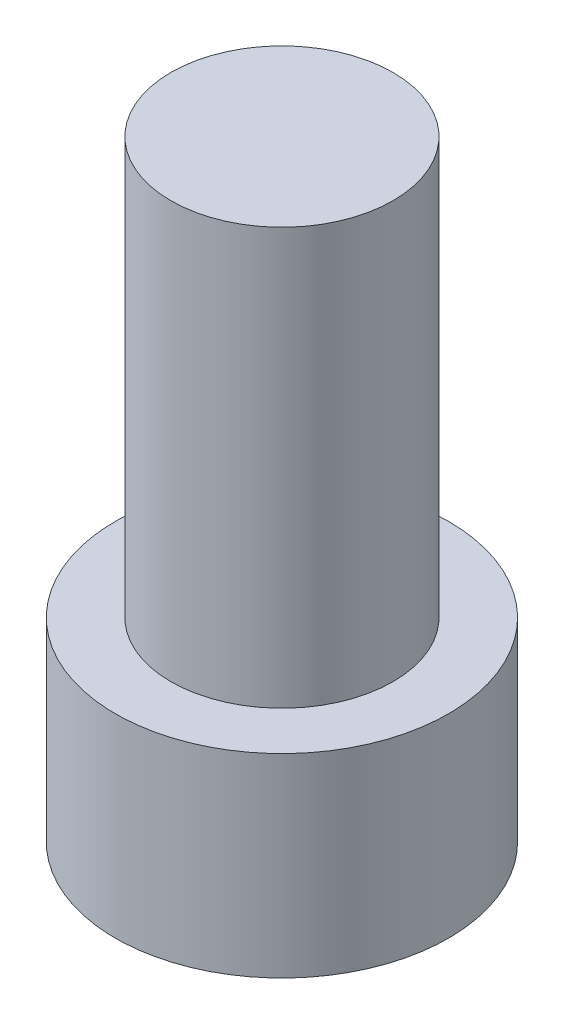
ISO-10303-21;
HEADER;
FILE_DESCRIPTION(('STEP AP214'),'2;1');
FILE_NAME('part.step','',(''),(''),'','','');
FILE_SCHEMA(('AUTOMOTIVE_DESIGN { 1 0 10303 214 1 1 1 1 }'));
ENDSEC;
DATA;
#1=APPLICATION_CONTEXT('core data for automotive mechanical design processes');
#2=APPLICATION_PROTOCOL_DEFINITION('international standard','automotive_design',2000,#1);
#3=PRODUCT_CONTEXT('',#1,'mechanical');
#4=PRODUCT('Part','Part','',(#3));
#5=PRODUCT_RELATED_PRODUCT_CATEGORY('part','',(#4));
#6=PRODUCT_DEFINITION_FORMATION('','',#4);
#7=PRODUCT_DEFINITION_CONTEXT('part definition',#1,'design');
#8=PRODUCT_DEFINITION('design','',#6,#7);
#9=PRODUCT_DEFINITION_SHAPE('','',#8);
#10=(LENGTH_UNIT() NAMED_UNIT(*) SI_UNIT(.MILLI.,.METRE.));
#11=(NAMED_UNIT(*) PLANE_ANGLE_UNIT() SI_UNIT($,.RADIAN.));
#12=(NAMED_UNIT(*) SI_UNIT($,.STERADIAN.) SOLID_ANGLE_UNIT());
#13=UNCERTAINTY_MEASURE_WITH_UNIT(LENGTH_MEASURE(1.E-05),#10,'distance_accuracy_value','');
#14=(GEOMETRIC_REPRESENTATION_CONTEXT(3) GLOBAL_UNCERTAINTY_ASSIGNED_CONTEXT((#13)) GLOBAL_UNIT_ASSIGNED_CONTEXT((#10,
#11,#12)) REPRESENTATION_CONTEXT('',''));
#15=CARTESIAN_POINT('',(0.,0.,0.));
#16=DIRECTION('',(0.,0.,1.));
#17=DIRECTION('',(1.,0.,0.));
#18=AXIS2_PLACEMENT_3D('',#15,#16,#17);
#19=CARTESIAN_POINT('',(0.,-2.,0.));
#20=DIRECTION('',(0.,1.,0.));
#21=DIRECTION('',(0.,0.,1.));
#22=AXIS2_PLACEMENT_3D('',#19,#20,#21);
#23=CYLINDRICAL_SURFACE('',#22,6.);
#24=CARTESIAN_POINT('',(0.,0.,0.));
#25=DIRECTION('',(0.,-1.,0.));
#26=DIRECTION('',(0.,0.,-1.));
#27=AXIS2_PLACEMENT_3D('',#24,#25,#26);
#28=CIRCLE('',#27,6.);
#29=CARTESIAN_POINT('',(0.,0.,-6.));
#30=VERTEX_POINT('',#29);
#31=EDGE_CURVE('E12',#30,#30,#28,.T.);
#32=ORIENTED_EDGE('',*,*,#31,.T.);
#33=EDGE_LOOP('',(#32));
#34=FACE_BOUND('',#33,.T.);
#35=CARTESIAN_POINT('',(0.,-7.,0.));
#36=DIRECTION('',(0.,-1.,0.));
#37=DIRECTION('',(0.,0.,-1.));
#38=AXIS2_PLACEMENT_3D('',#35,#36,#37);
#39=CIRCLE('',#38,6.);
#40=CARTESIAN_POINT('',(0.,-7.,-6.));
#41=VERTEX_POINT('',#40);
#42=EDGE_CURVE('E58',#41,#41,#39,.T.);
#43=ORIENTED_EDGE('',*,*,#42,.F.);
#44=EDGE_LOOP('',(#43));
#45=FACE_BOUND('',#44,.T.);
#46=ADVANCED_FACE('F51',(#34,#45),#23,.T.);
#47=CARTESIAN_POINT('',(0.,0.,0.));
#48=DIRECTION('',(0.,-1.,0.));
#49=DIRECTION('',(0.,0.,-1.));
#50=AXIS2_PLACEMENT_3D('',#47,#48,#49);
#51=PLANE('',#50);
#52=ORIENTED_EDGE('',*,*,#31,.F.);
#53=EDGE_LOOP('',(#52));
#54=FACE_BOUND('',#53,.T.);
#55=ADVANCED_FACE('F157',(#54),#51,.F.);
#56=CARTESIAN_POINT('',(0.,-7.,0.));
#57=DIRECTION('',(0.,-1.,0.));
#58=DIRECTION('',(0.,0.,-1.));
#59=AXIS2_PLACEMENT_3D('',#56,#57,#58);
#60=PLANE('',#59);
#61=ORIENTED_EDGE('',*,*,#42,.T.);
#62=EDGE_LOOP('',(#61));
#63=FACE_BOUND('',#62,.T.);
#64=DIRECTION('',(-0.5,0.,0.866025403784439));
#65=VECTOR('',#64,1.);
#66=CARTESIAN_POINT('',(4.61880215351701,-7.,0.));
#67=LINE('',#66,#65);
#68=CARTESIAN_POINT('',(4.61880215351701,-7.,0.));
#69=VERTEX_POINT('',#68);
#70=CARTESIAN_POINT('',(2.3094010767585,-7.,4.));
#71=VERTEX_POINT('',#70);
#72=EDGE_CURVE('E111',#69,#71,#67,.T.);
#73=ORIENTED_EDGE('',*,*,#72,.F.);
#74=DIRECTION('',(0.5,0.,0.866025403784439));
#75=VECTOR('',#74,1.);
#76=CARTESIAN_POINT('',(2.3094010767585,-7.,-4.));
#77=LINE('',#76,#75);
#78=CARTESIAN_POINT('',(2.3094010767585,-7.,-4.));
#79=VERTEX_POINT('',#78);
#80=EDGE_CURVE('E102',#79,#69,#77,.T.);
#81=ORIENTED_EDGE('',*,*,#80,.F.);
#82=DIRECTION('',(1.,0.,0.));
#83=VECTOR('',#82,1.);
#84=CARTESIAN_POINT('',(-2.3094010767585,-7.,-4.));
#85=LINE('',#84,#83);
#86=CARTESIAN_POINT('',(-2.3094010767585,-7.,-4.));
#87=VERTEX_POINT('',#86);
#88=EDGE_CURVE('E131',#87,#79,#85,.T.);
#89=ORIENTED_EDGE('',*,*,#88,.F.);
#90=DIRECTION('',(0.5,0.,-0.866025403784439));
#91=VECTOR('',#90,1.);
#92=CARTESIAN_POINT('',(-4.61880215351701,-7.,0.));
#93=LINE('',#92,#91);
#94=CARTESIAN_POINT('',(-4.61880215351701,-7.,0.));
#95=VERTEX_POINT('',#94);
#96=EDGE_CURVE('E128',#95,#87,#93,.T.);
#97=ORIENTED_EDGE('',*,*,#96,.F.);
#98=DIRECTION('',(-0.5,0.,-0.866025403784439));
#99=VECTOR('',#98,1.);
#100=CARTESIAN_POINT('',(-2.3094010767585,-7.,4.));
#101=LINE('',#100,#99);
#102=CARTESIAN_POINT('',(-2.3094010767585,-7.,4.));
#103=VERTEX_POINT('',#102);
#104=EDGE_CURVE('E124',#103,#95,#101,.T.);
#105=ORIENTED_EDGE('',*,*,#104,.F.);
#106=DIRECTION('',(-1.,0.,0.));
#107=VECTOR('',#106,1.);
#108=CARTESIAN_POINT('',(2.3094010767585,-7.,4.));
#109=LINE('',#108,#107);
#110=EDGE_CURVE('E122',#71,#103,#109,.T.);
#111=ORIENTED_EDGE('',*,*,#110,.F.);
#112=EDGE_LOOP('',(#73,#81,#89,#97,#105,#111));
#113=FACE_BOUND('',#112,.T.);
#114=ADVANCED_FACE('F120',(#63,#113),#60,.T.);
#115=CARTESIAN_POINT('',(2.3094010767585,-7.,-4.));
#116=DIRECTION('',(-0.866025403784439,0.,0.5));
#117=DIRECTION('',(0.5,0.,0.866025403784439));
#118=AXIS2_PLACEMENT_3D('',#115,#116,#117);
#119=PLANE('',#118);
#120=DIRECTION('',(0.5,0.,0.866025403784439));
#121=VECTOR('',#120,1.);
#122=CARTESIAN_POINT('',(2.3094010767585,-2.,-4.));
#123=LINE('',#122,#121);
#124=CARTESIAN_POINT('',(2.3094010767585,-2.,-4.));
#125=VERTEX_POINT('',#124);
#126=CARTESIAN_POINT('',(4.61880215351701,-2.,0.));
#127=VERTEX_POINT('',#126);
#128=EDGE_CURVE('E65',#125,#127,#123,.T.);
#129=ORIENTED_EDGE('',*,*,#128,.F.);
#130=DIRECTION('',(0.,1.,0.));
#131=VECTOR('',#130,1.);
#132=CARTESIAN_POINT('',(2.3094010767585,-7.,-4.));
#133=LINE('',#132,#131);
#134=EDGE_CURVE('E107',#79,#125,#133,.T.);
#135=ORIENTED_EDGE('',*,*,#134,.F.);
#136=ORIENTED_EDGE('',*,*,#80,.T.);
#137=DIRECTION('',(0.,1.,0.));
#138=VECTOR('',#137,1.);
#139=CARTESIAN_POINT('',(4.61880215351701,-7.,0.));
#140=LINE('',#139,#138);
#141=EDGE_CURVE('E105',#69,#127,#140,.T.);
#142=ORIENTED_EDGE('',*,*,#141,.T.);
#143=EDGE_LOOP('',(#129,#135,#136,#142));
#144=FACE_BOUND('',#143,.T.);
#145=ADVANCED_FACE('F104',(#144),#119,.T.);
#146=CARTESIAN_POINT('',(4.61880215351701,-7.,0.));
#147=DIRECTION('',(-0.866025403784438,0.,-0.5));
#148=DIRECTION('',(-0.5,0.,0.866025403784439));
#149=AXIS2_PLACEMENT_3D('',#146,#147,#148);
#150=PLANE('',#149);
#151=DIRECTION('',(-0.5,0.,0.866025403784439));
#152=VECTOR('',#151,1.);
#153=CARTESIAN_POINT('',(4.61880215351701,-2.,0.));
#154=LINE('',#153,#152);
#155=CARTESIAN_POINT('',(2.3094010767585,-2.,4.));
#156=VERTEX_POINT('',#155);
#157=EDGE_CURVE('E69',#127,#156,#154,.T.);
#158=ORIENTED_EDGE('',*,*,#157,.F.);
#159=ORIENTED_EDGE('',*,*,#141,.F.);
#160=ORIENTED_EDGE('',*,*,#72,.T.);
#161=DIRECTION('',(0.,1.,0.));
#162=VECTOR('',#161,1.);
#163=CARTESIAN_POINT('',(2.3094010767585,-7.,4.));
#164=LINE('',#163,#162);
#165=EDGE_CURVE('E117',#71,#156,#164,.T.);
#166=ORIENTED_EDGE('',*,*,#165,.T.);
#167=EDGE_LOOP('',(#158,#159,#160,#166));
#168=FACE_BOUND('',#167,.T.);
#169=ADVANCED_FACE('F115',(#168),#150,.T.);
#170=CARTESIAN_POINT('',(2.3094010767585,-7.,4.));
#171=DIRECTION('',(0.,0.,-1.));
#172=DIRECTION('',(-1.,0.,0.));
#173=AXIS2_PLACEMENT_3D('',#170,#171,#172);
#174=PLANE('',#173);
#175=DIRECTION('',(-1.,0.,0.));
#176=VECTOR('',#175,1.);
#177=CARTESIAN_POINT('',(2.3094010767585,-2.,4.));
#178=LINE('',#177,#176);
#179=CARTESIAN_POINT('',(-2.3094010767585,-2.,4.));
#180=VERTEX_POINT('',#179);
#181=EDGE_CURVE('E135',#156,#180,#178,.T.);
#182=ORIENTED_EDGE('',*,*,#181,.F.);
#183=ORIENTED_EDGE('',*,*,#165,.F.);
#184=ORIENTED_EDGE('',*,*,#110,.T.);
#185=DIRECTION('',(0.,1.,0.));
#186=VECTOR('',#185,1.);
#187=CARTESIAN_POINT('',(-2.3094010767585,-7.,4.));
#188=LINE('',#187,#186);
#189=EDGE_CURVE('E149',#103,#180,#188,.T.);
#190=ORIENTED_EDGE('',*,*,#189,.T.);
#191=EDGE_LOOP('',(#182,#183,#184,#190));
#192=FACE_BOUND('',#191,.T.);
#193=ADVANCED_FACE('F177',(#192),#174,.T.);
#194=CARTESIAN_POINT('',(-2.3094010767585,-7.,4.));
#195=DIRECTION('',(0.866025403784439,0.,-0.5));
#196=DIRECTION('',(-0.5,0.,-0.866025403784439));
#197=AXIS2_PLACEMENT_3D('',#194,#195,#196);
#198=PLANE('',#197);
#199=DIRECTION('',(-0.5,0.,-0.866025403784439));
#200=VECTOR('',#199,1.);
#201=CARTESIAN_POINT('',(-2.3094010767585,-2.,4.));
#202=LINE('',#201,#200);
#203=CARTESIAN_POINT('',(-4.61880215351701,-2.,0.));
#204=VERTEX_POINT('',#203);
#205=EDGE_CURVE('E137',#180,#204,#202,.T.);
#206=ORIENTED_EDGE('',*,*,#205,.F.);
#207=ORIENTED_EDGE('',*,*,#189,.F.);
#208=ORIENTED_EDGE('',*,*,#104,.T.);
#209=DIRECTION('',(0.,1.,0.));
#210=VECTOR('',#209,1.);
#211=CARTESIAN_POINT('',(-4.61880215351701,-7.,0.));
#212=LINE('',#211,#210);
#213=EDGE_CURVE('E146',#95,#204,#212,.T.);
#214=ORIENTED_EDGE('',*,*,#213,.T.);
#215=EDGE_LOOP('',(#206,#207,#208,#214));
#216=FACE_BOUND('',#215,.T.);
#217=ADVANCED_FACE('F180',(#216),#198,.T.);
#218=CARTESIAN_POINT('',(-4.61880215351701,-7.,0.));
#219=DIRECTION('',(0.866025403784439,0.,0.5));
#220=DIRECTION('',(0.5,0.,-0.866025403784439));
#221=AXIS2_PLACEMENT_3D('',#218,#219,#220);
#222=PLANE('',#221);
#223=DIRECTION('',(0.5,0.,-0.866025403784439));
#224=VECTOR('',#223,1.);
#225=CARTESIAN_POINT('',(-4.61880215351701,-2.,0.));
#226=LINE('',#225,#224);
#227=CARTESIAN_POINT('',(-2.3094010767585,-2.,-4.));
#228=VERTEX_POINT('',#227);
#229=EDGE_CURVE('E139',#204,#228,#226,.T.);
#230=ORIENTED_EDGE('',*,*,#229,.F.);
#231=ORIENTED_EDGE('',*,*,#213,.F.);
#232=ORIENTED_EDGE('',*,*,#96,.T.);
#233=DIRECTION('',(0.,1.,0.));
#234=VECTOR('',#233,1.);
#235=CARTESIAN_POINT('',(-2.3094010767585,-7.,-4.));
#236=LINE('',#235,#234);
#237=EDGE_CURVE('E143',#87,#228,#236,.T.);
#238=ORIENTED_EDGE('',*,*,#237,.T.);
#239=EDGE_LOOP('',(#230,#231,#232,#238));
#240=FACE_BOUND('',#239,.T.);
#241=ADVANCED_FACE('F184',(#240),#222,.T.);
#242=CARTESIAN_POINT('',(-2.3094010767585,-7.,-4.));
#243=DIRECTION('',(0.,0.,1.));
#244=DIRECTION('',(1.,0.,0.));
#245=AXIS2_PLACEMENT_3D('',#242,#243,#244);
#246=PLANE('',#245);
#247=DIRECTION('',(1.,0.,0.));
#248=VECTOR('',#247,1.);
#249=CARTESIAN_POINT('',(-2.3094010767585,-2.,-4.));
#250=LINE('',#249,#248);
#251=EDGE_CURVE('E112',#228,#125,#250,.T.);
#252=ORIENTED_EDGE('',*,*,#251,.F.);
#253=ORIENTED_EDGE('',*,*,#237,.F.);
#254=ORIENTED_EDGE('',*,*,#88,.T.);
#255=ORIENTED_EDGE('',*,*,#134,.T.);
#256=EDGE_LOOP('',(#252,#253,#254,#255));
#257=FACE_BOUND('',#256,.T.);
#258=ADVANCED_FACE('F171',(#257),#246,.T.);
#259=CARTESIAN_POINT('',(0.,-2.,0.));
#260=DIRECTION('',(0.,-1.,0.));
#261=DIRECTION('',(0.,0.,-1.));
#262=AXIS2_PLACEMENT_3D('',#259,#260,#261);
#263=PLANE('',#262);
#264=ORIENTED_EDGE('',*,*,#128,.T.);
#265=ORIENTED_EDGE('',*,*,#157,.T.);
#266=ORIENTED_EDGE('',*,*,#181,.T.);
#267=ORIENTED_EDGE('',*,*,#205,.T.);
#268=ORIENTED_EDGE('',*,*,#229,.T.);
#269=ORIENTED_EDGE('',*,*,#251,.T.);
#270=EDGE_LOOP('',(#264,#265,#266,#267,#268,#269));
#271=FACE_BOUND('',#270,.T.);
#272=ADVANCED_FACE('F169',(#271),#263,.T.);
#273=CLOSED_SHELL('',(#46,#55,#114,#145,#169,#193,#217,#241,#258,#272));
#274=MANIFOLD_SOLID_BREP('B2',#273);
#275=CARTESIAN_POINT('',(0.,15.,0.));
#276=DIRECTION('',(0.,-1.,0.));
#277=DIRECTION('',(0.,0.,-1.));
#278=AXIS2_PLACEMENT_3D('',#275,#276,#277);
#279=CYLINDRICAL_SURFACE('',#278,4.);
#280=CARTESIAN_POINT('',(0.,15.,0.));
#281=DIRECTION('',(0.,1.,0.));
#282=DIRECTION('',(0.,0.,1.));
#283=AXIS2_PLACEMENT_3D('',#280,#281,#282);
#284=CIRCLE('',#283,4.);
#285=CARTESIAN_POINT('',(0.,15.,4.));
#286=VERTEX_POINT('',#285);
#287=EDGE_CURVE('E50',#286,#286,#284,.T.);
#288=ORIENTED_EDGE('',*,*,#287,.F.);
#289=EDGE_LOOP('',(#288));
#290=FACE_BOUND('',#289,.T.);
#291=CARTESIAN_POINT('',(0.,0.,0.));
#292=DIRECTION('',(0.,1.,0.));
#293=DIRECTION('',(0.,0.,1.));
#294=AXIS2_PLACEMENT_3D('',#291,#292,#293);
#295=CIRCLE('',#294,4.);
#296=CARTESIAN_POINT('',(0.,0.,4.));
#297=VERTEX_POINT('',#296);
#298=EDGE_CURVE('E283',#297,#297,#295,.T.);
#299=ORIENTED_EDGE('',*,*,#298,.T.);
#300=EDGE_LOOP('',(#299));
#301=FACE_BOUND('',#300,.T.);
#302=ADVANCED_FACE('F280',(#290,#301),#279,.T.);
#303=CARTESIAN_POINT('',(0.,15.,0.));
#304=DIRECTION('',(0.,1.,0.));
#305=DIRECTION('',(0.,0.,1.));
#306=AXIS2_PLACEMENT_3D('',#303,#304,#305);
#307=PLANE('',#306);
#308=ORIENTED_EDGE('',*,*,#287,.T.);
#309=EDGE_LOOP('',(#308));
#310=FACE_BOUND('',#309,.T.);
#311=ADVANCED_FACE('F297',(#310),#307,.T.);
#312=CARTESIAN_POINT('',(0.,0.,0.));
#313=DIRECTION('',(0.,1.,0.));
#314=DIRECTION('',(0.,0.,1.));
#315=AXIS2_PLACEMENT_3D('',#312,#313,#314);
#316=PLANE('',#315);
#317=ORIENTED_EDGE('',*,*,#298,.F.);
#318=EDGE_LOOP('',(#317));
#319=FACE_BOUND('',#318,.T.);
#320=ADVANCED_FACE('F295',(#319),#316,.F.);
#321=CLOSED_SHELL('',(#302,#311,#320));
#322=MANIFOLD_SOLID_BREP('B6',#321);
#323=ADVANCED_BREP_SHAPE_REPRESENTATION('',(#18,#274,#322),#14);
#324=SHAPE_DEFINITION_REPRESENTATION(#9,#323);
ENDSEC;
END-ISO-10303-21;
